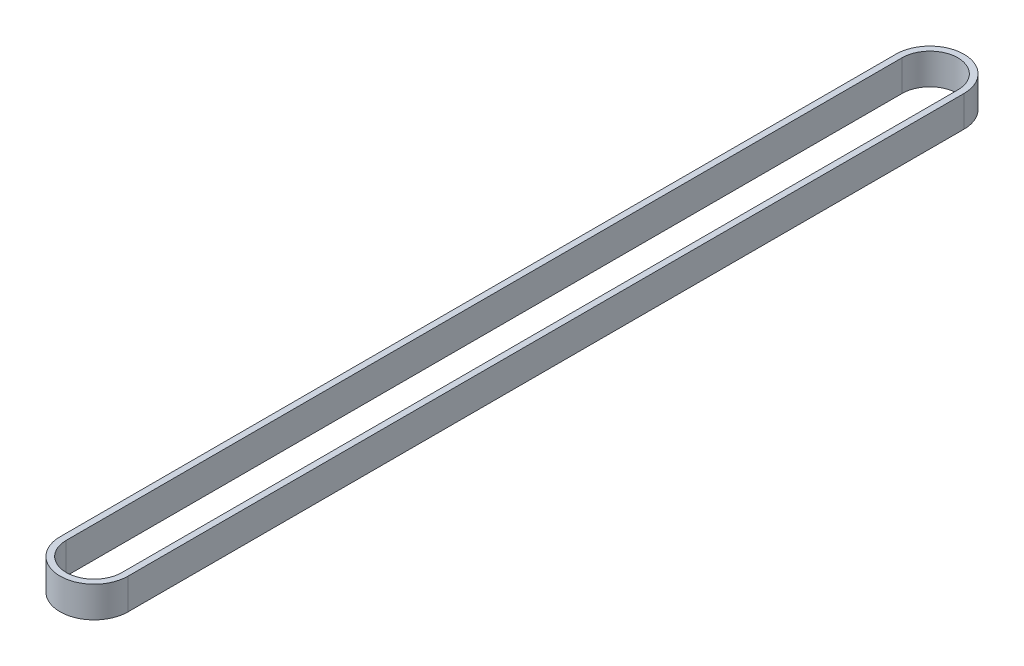
ISO-10303-21;
HEADER;
FILE_DESCRIPTION(('STEP AP214'),'2;1');
FILE_NAME('part.step','',(''),(''),'','','');
FILE_SCHEMA(('AUTOMOTIVE_DESIGN { 1 0 10303 214 1 1 1 1 }'));
ENDSEC;
DATA;
#1=APPLICATION_CONTEXT('core data for automotive mechanical design processes');
#2=APPLICATION_PROTOCOL_DEFINITION('international standard','automotive_design',2000,#1);
#3=PRODUCT_CONTEXT('',#1,'mechanical');
#4=PRODUCT('Part','Part','',(#3));
#5=PRODUCT_RELATED_PRODUCT_CATEGORY('part','',(#4));
#6=PRODUCT_DEFINITION_FORMATION('','',#4);
#7=PRODUCT_DEFINITION_CONTEXT('part definition',#1,'design');
#8=PRODUCT_DEFINITION('design','',#6,#7);
#9=PRODUCT_DEFINITION_SHAPE('','',#8);
#10=(LENGTH_UNIT() NAMED_UNIT(*) SI_UNIT(.MILLI.,.METRE.));
#11=(NAMED_UNIT(*) PLANE_ANGLE_UNIT() SI_UNIT($,.RADIAN.));
#12=(NAMED_UNIT(*) SI_UNIT($,.STERADIAN.) SOLID_ANGLE_UNIT());
#13=UNCERTAINTY_MEASURE_WITH_UNIT(LENGTH_MEASURE(1.E-05),#10,'distance_accuracy_value','');
#14=(GEOMETRIC_REPRESENTATION_CONTEXT(3) GLOBAL_UNCERTAINTY_ASSIGNED_CONTEXT((#13)) GLOBAL_UNIT_ASSIGNED_CONTEXT((#10,
#11,#12)) REPRESENTATION_CONTEXT('',''));
#15=CARTESIAN_POINT('',(0.,0.,0.));
#16=DIRECTION('',(0.,0.,1.));
#17=DIRECTION('',(1.,0.,0.));
#18=AXIS2_PLACEMENT_3D('',#15,#16,#17);
#19=CARTESIAN_POINT('',(0.,10.,270.));
#20=DIRECTION('',(0.,1.,0.));
#21=DIRECTION('',(0.,0.,1.));
#22=AXIS2_PLACEMENT_3D('',#19,#20,#21);
#23=PLANE('',#22);
#24=CARTESIAN_POINT('',(0.,10.,270.));
#25=DIRECTION('',(0.,1.,0.));
#26=DIRECTION('',(0.,0.,1.));
#27=AXIS2_PLACEMENT_3D('',#24,#25,#26);
#28=CIRCLE('',#27,11.);
#29=CARTESIAN_POINT('',(-11.,10.,270.));
#30=VERTEX_POINT('',#29);
#31=CARTESIAN_POINT('',(11.,10.,270.));
#32=VERTEX_POINT('',#31);
#33=EDGE_CURVE('E133',#30,#32,#28,.T.);
#34=ORIENTED_EDGE('',*,*,#33,.T.);
#35=DIRECTION('',(0.,0.,-1.));
#36=VECTOR('',#35,1.);
#37=CARTESIAN_POINT('',(11.,10.,0.));
#38=LINE('',#37,#36);
#39=CARTESIAN_POINT('',(11.,10.,0.));
#40=VERTEX_POINT('',#39);
#41=EDGE_CURVE('E136',#32,#40,#38,.T.);
#42=ORIENTED_EDGE('',*,*,#41,.T.);
#43=CARTESIAN_POINT('',(0.,10.,0.));
#44=DIRECTION('',(0.,1.,0.));
#45=DIRECTION('',(0.,0.,1.));
#46=AXIS2_PLACEMENT_3D('',#43,#44,#45);
#47=CIRCLE('',#46,11.);
#48=CARTESIAN_POINT('',(-11.,10.,0.));
#49=VERTEX_POINT('',#48);
#50=EDGE_CURVE('E139',#40,#49,#47,.T.);
#51=ORIENTED_EDGE('',*,*,#50,.T.);
#52=DIRECTION('',(0.,0.,1.));
#53=VECTOR('',#52,1.);
#54=CARTESIAN_POINT('',(-11.,10.,270.));
#55=LINE('',#54,#53);
#56=EDGE_CURVE('E141',#49,#30,#55,.T.);
#57=ORIENTED_EDGE('',*,*,#56,.T.);
#58=EDGE_LOOP('',(#34,#42,#51,#57));
#59=FACE_BOUND('',#58,.T.);
#60=DIRECTION('',(0.,0.,-1.));
#61=VECTOR('',#60,1.);
#62=CARTESIAN_POINT('',(9.,10.,0.));
#63=LINE('',#62,#61);
#64=CARTESIAN_POINT('',(9.00000000000003,10.,270.));
#65=VERTEX_POINT('',#64);
#66=CARTESIAN_POINT('',(9.,10.,0.));
#67=VERTEX_POINT('',#66);
#68=EDGE_CURVE('E105',#65,#67,#63,.T.);
#69=ORIENTED_EDGE('',*,*,#68,.F.);
#70=CARTESIAN_POINT('',(0.,10.,270.));
#71=DIRECTION('',(0.,1.,0.));
#72=DIRECTION('',(0.,0.,1.));
#73=AXIS2_PLACEMENT_3D('',#70,#71,#72);
#74=CIRCLE('',#73,9.);
#75=CARTESIAN_POINT('',(-8.99999999999997,10.,270.));
#76=VERTEX_POINT('',#75);
#77=EDGE_CURVE('E97',#76,#65,#74,.T.);
#78=ORIENTED_EDGE('',*,*,#77,.F.);
#79=DIRECTION('',(0.,0.,1.));
#80=VECTOR('',#79,1.);
#81=CARTESIAN_POINT('',(-8.99999999999997,10.,270.));
#82=LINE('',#81,#80);
#83=CARTESIAN_POINT('',(-9.,10.,0.));
#84=VERTEX_POINT('',#83);
#85=EDGE_CURVE('E119',#84,#76,#82,.T.);
#86=ORIENTED_EDGE('',*,*,#85,.F.);
#87=CARTESIAN_POINT('',(0.,10.,0.));
#88=DIRECTION('',(0.,1.,0.));
#89=DIRECTION('',(0.,0.,1.));
#90=AXIS2_PLACEMENT_3D('',#87,#88,#89);
#91=CIRCLE('',#90,9.);
#92=EDGE_CURVE('E117',#67,#84,#91,.T.);
#93=ORIENTED_EDGE('',*,*,#92,.F.);
#94=EDGE_LOOP('',(#69,#78,#86,#93));
#95=FACE_BOUND('',#94,.T.);
#96=ADVANCED_FACE('F32',(#59,#95),#23,.T.);
#97=CARTESIAN_POINT('',(0.,0.,270.));
#98=DIRECTION('',(0.,1.,0.));
#99=DIRECTION('',(0.,0.,1.));
#100=AXIS2_PLACEMENT_3D('',#97,#98,#99);
#101=PLANE('',#100);
#102=CARTESIAN_POINT('',(0.,0.,270.));
#103=DIRECTION('',(0.,1.,0.));
#104=DIRECTION('',(0.,0.,1.));
#105=AXIS2_PLACEMENT_3D('',#102,#103,#104);
#106=CIRCLE('',#105,11.);
#107=CARTESIAN_POINT('',(-11.,0.,270.));
#108=VERTEX_POINT('',#107);
#109=CARTESIAN_POINT('',(11.,0.,270.));
#110=VERTEX_POINT('',#109);
#111=EDGE_CURVE('E113',#108,#110,#106,.T.);
#112=ORIENTED_EDGE('',*,*,#111,.F.);
#113=DIRECTION('',(0.,0.,1.));
#114=VECTOR('',#113,1.);
#115=CARTESIAN_POINT('',(-11.,0.,270.));
#116=LINE('',#115,#114);
#117=CARTESIAN_POINT('',(-11.,0.,0.));
#118=VERTEX_POINT('',#117);
#119=EDGE_CURVE('E137',#118,#108,#116,.T.);
#120=ORIENTED_EDGE('',*,*,#119,.F.);
#121=CARTESIAN_POINT('',(0.,0.,0.));
#122=DIRECTION('',(0.,1.,0.));
#123=DIRECTION('',(0.,0.,1.));
#124=AXIS2_PLACEMENT_3D('',#121,#122,#123);
#125=CIRCLE('',#124,11.);
#126=CARTESIAN_POINT('',(11.,0.,0.));
#127=VERTEX_POINT('',#126);
#128=EDGE_CURVE('E148',#127,#118,#125,.T.);
#129=ORIENTED_EDGE('',*,*,#128,.F.);
#130=DIRECTION('',(0.,0.,-1.));
#131=VECTOR('',#130,1.);
#132=CARTESIAN_POINT('',(11.,0.,0.));
#133=LINE('',#132,#131);
#134=EDGE_CURVE('E146',#110,#127,#133,.T.);
#135=ORIENTED_EDGE('',*,*,#134,.F.);
#136=EDGE_LOOP('',(#112,#120,#129,#135));
#137=FACE_BOUND('',#136,.T.);
#138=CARTESIAN_POINT('',(0.,0.,270.));
#139=DIRECTION('',(0.,1.,0.));
#140=DIRECTION('',(0.,0.,1.));
#141=AXIS2_PLACEMENT_3D('',#138,#139,#140);
#142=CIRCLE('',#141,9.);
#143=CARTESIAN_POINT('',(-8.99999999999997,0.,270.));
#144=VERTEX_POINT('',#143);
#145=CARTESIAN_POINT('',(9.00000000000003,0.,270.));
#146=VERTEX_POINT('',#145);
#147=EDGE_CURVE('E55',#144,#146,#142,.T.);
#148=ORIENTED_EDGE('',*,*,#147,.T.);
#149=DIRECTION('',(0.,0.,-1.));
#150=VECTOR('',#149,1.);
#151=CARTESIAN_POINT('',(9.,0.,0.));
#152=LINE('',#151,#150);
#153=CARTESIAN_POINT('',(9.,0.,0.));
#154=VERTEX_POINT('',#153);
#155=EDGE_CURVE('E112',#146,#154,#152,.T.);
#156=ORIENTED_EDGE('',*,*,#155,.T.);
#157=CARTESIAN_POINT('',(0.,0.,0.));
#158=DIRECTION('',(0.,1.,0.));
#159=DIRECTION('',(0.,0.,1.));
#160=AXIS2_PLACEMENT_3D('',#157,#158,#159);
#161=CIRCLE('',#160,9.);
#162=CARTESIAN_POINT('',(-9.,0.,0.));
#163=VERTEX_POINT('',#162);
#164=EDGE_CURVE('E125',#154,#163,#161,.T.);
#165=ORIENTED_EDGE('',*,*,#164,.T.);
#166=DIRECTION('',(0.,0.,1.));
#167=VECTOR('',#166,1.);
#168=CARTESIAN_POINT('',(-8.99999999999997,0.,270.));
#169=LINE('',#168,#167);
#170=EDGE_CURVE('E106',#163,#144,#169,.T.);
#171=ORIENTED_EDGE('',*,*,#170,.T.);
#172=EDGE_LOOP('',(#148,#156,#165,#171));
#173=FACE_BOUND('',#172,.T.);
#174=ADVANCED_FACE('F166',(#137,#173),#101,.F.);
#175=CARTESIAN_POINT('',(0.,10.,270.));
#176=DIRECTION('',(0.,-1.,0.));
#177=DIRECTION('',(0.,0.,-1.));
#178=AXIS2_PLACEMENT_3D('',#175,#176,#177);
#179=CYLINDRICAL_SURFACE('',#178,11.);
#180=ORIENTED_EDGE('',*,*,#111,.T.);
#181=DIRECTION('',(0.,-1.,0.));
#182=VECTOR('',#181,1.);
#183=CARTESIAN_POINT('',(11.,10.,270.));
#184=LINE('',#183,#182);
#185=EDGE_CURVE('E11',#32,#110,#184,.T.);
#186=ORIENTED_EDGE('',*,*,#185,.F.);
#187=ORIENTED_EDGE('',*,*,#33,.F.);
#188=DIRECTION('',(0.,-1.,0.));
#189=VECTOR('',#188,1.);
#190=CARTESIAN_POINT('',(-11.,10.,270.));
#191=LINE('',#190,#189);
#192=EDGE_CURVE('E143',#30,#108,#191,.T.);
#193=ORIENTED_EDGE('',*,*,#192,.T.);
#194=EDGE_LOOP('',(#180,#186,#187,#193));
#195=FACE_BOUND('',#194,.T.);
#196=ADVANCED_FACE('F34',(#195),#179,.T.);
#197=CARTESIAN_POINT('',(11.,10.,0.));
#198=DIRECTION('',(-1.,0.,0.));
#199=DIRECTION('',(0.,0.,1.));
#200=AXIS2_PLACEMENT_3D('',#197,#198,#199);
#201=PLANE('',#200);
#202=ORIENTED_EDGE('',*,*,#134,.T.);
#203=DIRECTION('',(0.,-1.,0.));
#204=VECTOR('',#203,1.);
#205=CARTESIAN_POINT('',(11.,10.,0.));
#206=LINE('',#205,#204);
#207=EDGE_CURVE('E40',#40,#127,#206,.T.);
#208=ORIENTED_EDGE('',*,*,#207,.F.);
#209=ORIENTED_EDGE('',*,*,#41,.F.);
#210=ORIENTED_EDGE('',*,*,#185,.T.);
#211=EDGE_LOOP('',(#202,#208,#209,#210));
#212=FACE_BOUND('',#211,.T.);
#213=ADVANCED_FACE('F176',(#212),#201,.F.);
#214=CARTESIAN_POINT('',(0.,10.,0.));
#215=DIRECTION('',(0.,-1.,0.));
#216=DIRECTION('',(0.,0.,-1.));
#217=AXIS2_PLACEMENT_3D('',#214,#215,#216);
#218=CYLINDRICAL_SURFACE('',#217,11.);
#219=ORIENTED_EDGE('',*,*,#128,.T.);
#220=DIRECTION('',(0.,-1.,0.));
#221=VECTOR('',#220,1.);
#222=CARTESIAN_POINT('',(-11.,10.,0.));
#223=LINE('',#222,#221);
#224=EDGE_CURVE('E153',#49,#118,#223,.T.);
#225=ORIENTED_EDGE('',*,*,#224,.F.);
#226=ORIENTED_EDGE('',*,*,#50,.F.);
#227=ORIENTED_EDGE('',*,*,#207,.T.);
#228=EDGE_LOOP('',(#219,#225,#226,#227));
#229=FACE_BOUND('',#228,.T.);
#230=ADVANCED_FACE('F160',(#229),#218,.T.);
#231=CARTESIAN_POINT('',(-11.,10.,270.));
#232=DIRECTION('',(1.,0.,0.));
#233=DIRECTION('',(0.,0.,-1.));
#234=AXIS2_PLACEMENT_3D('',#231,#232,#233);
#235=PLANE('',#234);
#236=ORIENTED_EDGE('',*,*,#119,.T.);
#237=ORIENTED_EDGE('',*,*,#192,.F.);
#238=ORIENTED_EDGE('',*,*,#56,.F.);
#239=ORIENTED_EDGE('',*,*,#224,.T.);
#240=EDGE_LOOP('',(#236,#237,#238,#239));
#241=FACE_BOUND('',#240,.T.);
#242=ADVANCED_FACE('F170',(#241),#235,.F.);
#243=CARTESIAN_POINT('',(0.,10.,270.));
#244=DIRECTION('',(0.,-1.,0.));
#245=DIRECTION('',(0.,0.,-1.));
#246=AXIS2_PLACEMENT_3D('',#243,#244,#245);
#247=CYLINDRICAL_SURFACE('',#246,9.);
#248=ORIENTED_EDGE('',*,*,#147,.F.);
#249=DIRECTION('',(0.,-1.,0.));
#250=VECTOR('',#249,1.);
#251=CARTESIAN_POINT('',(-8.99999999999997,10.,270.));
#252=LINE('',#251,#250);
#253=EDGE_CURVE('E101',#76,#144,#252,.T.);
#254=ORIENTED_EDGE('',*,*,#253,.F.);
#255=ORIENTED_EDGE('',*,*,#77,.T.);
#256=DIRECTION('',(0.,-1.,0.));
#257=VECTOR('',#256,1.);
#258=CARTESIAN_POINT('',(9.00000000000003,10.,270.));
#259=LINE('',#258,#257);
#260=EDGE_CURVE('E100',#65,#146,#259,.T.);
#261=ORIENTED_EDGE('',*,*,#260,.T.);
#262=EDGE_LOOP('',(#248,#254,#255,#261));
#263=FACE_BOUND('',#262,.T.);
#264=ADVANCED_FACE('F99',(#263),#247,.F.);
#265=CARTESIAN_POINT('',(9.,10.,0.));
#266=DIRECTION('',(-1.,0.,0.));
#267=DIRECTION('',(0.,0.,1.));
#268=AXIS2_PLACEMENT_3D('',#265,#266,#267);
#269=PLANE('',#268);
#270=ORIENTED_EDGE('',*,*,#155,.F.);
#271=ORIENTED_EDGE('',*,*,#260,.F.);
#272=ORIENTED_EDGE('',*,*,#68,.T.);
#273=DIRECTION('',(0.,-1.,0.));
#274=VECTOR('',#273,1.);
#275=CARTESIAN_POINT('',(9.,10.,0.));
#276=LINE('',#275,#274);
#277=EDGE_CURVE('E114',#67,#154,#276,.T.);
#278=ORIENTED_EDGE('',*,*,#277,.T.);
#279=EDGE_LOOP('',(#270,#271,#272,#278));
#280=FACE_BOUND('',#279,.T.);
#281=ADVANCED_FACE('F109',(#280),#269,.T.);
#282=CARTESIAN_POINT('',(0.,10.,0.));
#283=DIRECTION('',(0.,-1.,0.));
#284=DIRECTION('',(0.,0.,-1.));
#285=AXIS2_PLACEMENT_3D('',#282,#283,#284);
#286=CYLINDRICAL_SURFACE('',#285,9.);
#287=ORIENTED_EDGE('',*,*,#164,.F.);
#288=ORIENTED_EDGE('',*,*,#277,.F.);
#289=ORIENTED_EDGE('',*,*,#92,.T.);
#290=DIRECTION('',(0.,-1.,0.));
#291=VECTOR('',#290,1.);
#292=CARTESIAN_POINT('',(-9.,10.,0.));
#293=LINE('',#292,#291);
#294=EDGE_CURVE('E47',#84,#163,#293,.T.);
#295=ORIENTED_EDGE('',*,*,#294,.T.);
#296=EDGE_LOOP('',(#287,#288,#289,#295));
#297=FACE_BOUND('',#296,.T.);
#298=ADVANCED_FACE('F199',(#297),#286,.F.);
#299=CARTESIAN_POINT('',(-8.99999999999997,10.,270.));
#300=DIRECTION('',(1.,0.,0.));
#301=DIRECTION('',(0.,0.,-1.));
#302=AXIS2_PLACEMENT_3D('',#299,#300,#301);
#303=PLANE('',#302);
#304=ORIENTED_EDGE('',*,*,#170,.F.);
#305=ORIENTED_EDGE('',*,*,#294,.F.);
#306=ORIENTED_EDGE('',*,*,#85,.T.);
#307=ORIENTED_EDGE('',*,*,#253,.T.);
#308=EDGE_LOOP('',(#304,#305,#306,#307));
#309=FACE_BOUND('',#308,.T.);
#310=ADVANCED_FACE('F203',(#309),#303,.T.);
#311=CLOSED_SHELL('',(#96,#174,#196,#213,#230,#242,#264,#281,#298,#310));
#312=MANIFOLD_SOLID_BREP('B2',#311);
#313=ADVANCED_BREP_SHAPE_REPRESENTATION('',(#18,#312),#14);
#314=SHAPE_DEFINITION_REPRESENTATION(#9,#313);
ENDSEC;
END-ISO-10303-21;
